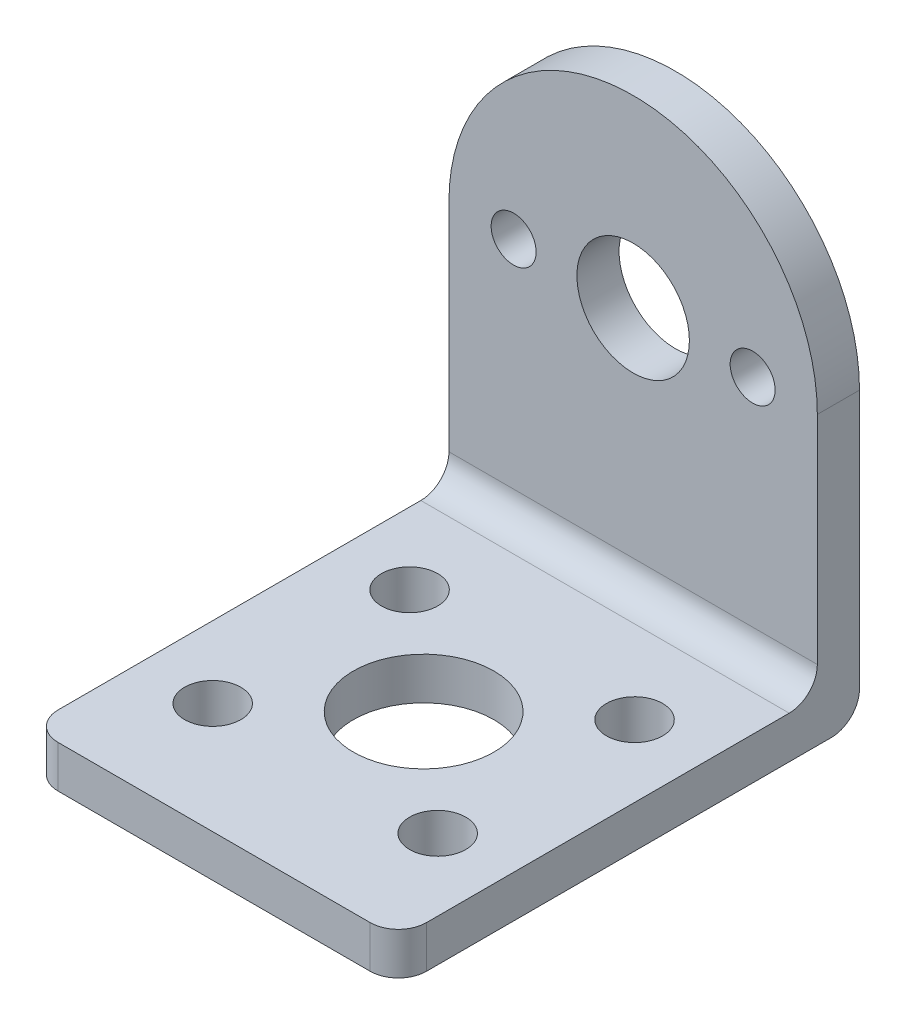
ISO-10303-21;
HEADER;
FILE_DESCRIPTION(('STEP AP214'),'2;1');
FILE_NAME('part.step','',(''),(''),'','','');
FILE_SCHEMA(('AUTOMOTIVE_DESIGN { 1 0 10303 214 1 1 1 1 }'));
ENDSEC;
DATA;
#1=APPLICATION_CONTEXT('core data for automotive mechanical design processes');
#2=APPLICATION_PROTOCOL_DEFINITION('international standard','automotive_design',2000,#1);
#3=PRODUCT_CONTEXT('',#1,'mechanical');
#4=PRODUCT('Part','Part','',(#3));
#5=PRODUCT_RELATED_PRODUCT_CATEGORY('part','',(#4));
#6=PRODUCT_DEFINITION_FORMATION('','',#4);
#7=PRODUCT_DEFINITION_CONTEXT('part definition',#1,'design');
#8=PRODUCT_DEFINITION('design','',#6,#7);
#9=PRODUCT_DEFINITION_SHAPE('','',#8);
#10=(LENGTH_UNIT() NAMED_UNIT(*) SI_UNIT(.MILLI.,.METRE.));
#11=(NAMED_UNIT(*) PLANE_ANGLE_UNIT() SI_UNIT($,.RADIAN.));
#12=(NAMED_UNIT(*) SI_UNIT($,.STERADIAN.) SOLID_ANGLE_UNIT());
#13=UNCERTAINTY_MEASURE_WITH_UNIT(LENGTH_MEASURE(1.E-05),#10,'distance_accuracy_value','');
#14=(GEOMETRIC_REPRESENTATION_CONTEXT(3) GLOBAL_UNCERTAINTY_ASSIGNED_CONTEXT((#13)) GLOBAL_UNIT_ASSIGNED_CONTEXT((#10,
#11,#12)) REPRESENTATION_CONTEXT('',''));
#15=CARTESIAN_POINT('',(0.,0.,0.));
#16=DIRECTION('',(0.,0.,1.));
#17=DIRECTION('',(1.,0.,0.));
#18=AXIS2_PLACEMENT_3D('',#15,#16,#17);
#19=CARTESIAN_POINT('',(0.,20.4,3.));
#20=DIRECTION('',(0.,0.,-1.));
#21=DIRECTION('',(-1.,0.,0.));
#22=AXIS2_PLACEMENT_3D('',#19,#20,#21);
#23=PLANE('',#22);
#24=DIRECTION('',(0.,-1.,0.));
#25=VECTOR('',#24,1.);
#26=CARTESIAN_POINT('',(-13.1,20.4,3.));
#27=LINE('',#26,#25);
#28=CARTESIAN_POINT('',(-13.1,20.4,3.));
#29=VERTEX_POINT('',#28);
#30=CARTESIAN_POINT('',(-13.1,5.,3.));
#31=VERTEX_POINT('',#30);
#32=EDGE_CURVE('E111',#29,#31,#27,.T.);
#33=ORIENTED_EDGE('',*,*,#32,.T.);
#34=DIRECTION('',(1.,0.,0.));
#35=VECTOR('',#34,1.);
#36=CARTESIAN_POINT('',(13.1,5.,3.));
#37=LINE('',#36,#35);
#38=CARTESIAN_POINT('',(13.1,5.,3.));
#39=VERTEX_POINT('',#38);
#40=EDGE_CURVE('E162',#31,#39,#37,.T.);
#41=ORIENTED_EDGE('',*,*,#40,.T.);
#42=DIRECTION('',(0.,1.,0.));
#43=VECTOR('',#42,1.);
#44=CARTESIAN_POINT('',(13.1,0.,3.));
#45=LINE('',#44,#43);
#46=CARTESIAN_POINT('',(13.1,20.4,3.));
#47=VERTEX_POINT('',#46);
#48=EDGE_CURVE('E123',#39,#47,#45,.T.);
#49=ORIENTED_EDGE('',*,*,#48,.T.);
#50=CARTESIAN_POINT('',(0.,20.4,3.));
#51=DIRECTION('',(0.,0.,1.));
#52=DIRECTION('',(-1.,0.,0.));
#53=AXIS2_PLACEMENT_3D('',#50,#51,#52);
#54=CIRCLE('',#53,13.1);
#55=EDGE_CURVE('E124',#47,#29,#54,.T.);
#56=ORIENTED_EDGE('',*,*,#55,.T.);
#57=EDGE_LOOP('',(#33,#41,#49,#56));
#58=FACE_BOUND('',#57,.T.);
#59=CARTESIAN_POINT('',(0.,20.4,3.));
#60=DIRECTION('',(0.,0.,1.));
#61=DIRECTION('',(1.,0.,0.));
#62=AXIS2_PLACEMENT_3D('',#59,#60,#61);
#63=CIRCLE('',#62,4.);
#64=CARTESIAN_POINT('',(4.,20.4,3.));
#65=VERTEX_POINT('',#64);
#66=EDGE_CURVE('E347',#65,#65,#63,.T.);
#67=ORIENTED_EDGE('',*,*,#66,.F.);
#68=EDGE_LOOP('',(#67));
#69=FACE_BOUND('',#68,.T.);
#70=CARTESIAN_POINT('',(-8.5,20.4,3.));
#71=DIRECTION('',(0.,0.,1.));
#72=DIRECTION('',(1.,0.,0.));
#73=AXIS2_PLACEMENT_3D('',#70,#71,#72);
#74=CIRCLE('',#73,1.6);
#75=CARTESIAN_POINT('',(-6.9,20.4,3.));
#76=VERTEX_POINT('',#75);
#77=EDGE_CURVE('E352',#76,#76,#74,.T.);
#78=ORIENTED_EDGE('',*,*,#77,.F.);
#79=EDGE_LOOP('',(#78));
#80=FACE_BOUND('',#79,.T.);
#81=CARTESIAN_POINT('',(8.5,20.4,3.));
#82=DIRECTION('',(0.,0.,1.));
#83=DIRECTION('',(1.,0.,0.));
#84=AXIS2_PLACEMENT_3D('',#81,#82,#83);
#85=CIRCLE('',#84,1.6);
#86=CARTESIAN_POINT('',(10.1,20.4,3.));
#87=VERTEX_POINT('',#86);
#88=EDGE_CURVE('E358',#87,#87,#85,.T.);
#89=ORIENTED_EDGE('',*,*,#88,.F.);
#90=EDGE_LOOP('',(#89));
#91=FACE_BOUND('',#90,.T.);
#92=ADVANCED_FACE('F33',(#58,#69,#80,#91),#23,.F.);
#93=CARTESIAN_POINT('',(0.,20.4,0.));
#94=DIRECTION('',(0.,0.,-1.));
#95=DIRECTION('',(-1.,0.,0.));
#96=AXIS2_PLACEMENT_3D('',#93,#94,#95);
#97=PLANE('',#96);
#98=CARTESIAN_POINT('',(-8.5,20.4,0.));
#99=DIRECTION('',(0.,0.,1.));
#100=DIRECTION('',(1.,0.,0.));
#101=AXIS2_PLACEMENT_3D('',#98,#99,#100);
#102=CIRCLE('',#101,1.6);
#103=CARTESIAN_POINT('',(-6.9,20.4,0.));
#104=VERTEX_POINT('',#103);
#105=EDGE_CURVE('E355',#104,#104,#102,.T.);
#106=ORIENTED_EDGE('',*,*,#105,.T.);
#107=EDGE_LOOP('',(#106));
#108=FACE_BOUND('',#107,.T.);
#109=DIRECTION('',(0.,1.,0.));
#110=VECTOR('',#109,1.);
#111=CARTESIAN_POINT('',(13.1,0.,0.));
#112=LINE('',#111,#110);
#113=CARTESIAN_POINT('',(13.1,2.,0.));
#114=VERTEX_POINT('',#113);
#115=CARTESIAN_POINT('',(13.1,20.4,0.));
#116=VERTEX_POINT('',#115);
#117=EDGE_CURVE('E132',#114,#116,#112,.T.);
#118=ORIENTED_EDGE('',*,*,#117,.F.);
#119=DIRECTION('',(1.,0.,0.));
#120=VECTOR('',#119,1.);
#121=CARTESIAN_POINT('',(-13.1,2.,0.));
#122=LINE('',#121,#120);
#123=CARTESIAN_POINT('',(-13.1,2.,0.));
#124=VERTEX_POINT('',#123);
#125=EDGE_CURVE('E156',#114,#124,#122,.F.);
#126=ORIENTED_EDGE('',*,*,#125,.T.);
#127=DIRECTION('',(0.,-1.,0.));
#128=VECTOR('',#127,1.);
#129=CARTESIAN_POINT('',(-13.1,20.4,0.));
#130=LINE('',#129,#128);
#131=CARTESIAN_POINT('',(-13.1,20.4,0.));
#132=VERTEX_POINT('',#131);
#133=EDGE_CURVE('E344',#132,#124,#130,.T.);
#134=ORIENTED_EDGE('',*,*,#133,.F.);
#135=CARTESIAN_POINT('',(0.,20.4,0.));
#136=DIRECTION('',(0.,0.,1.));
#137=DIRECTION('',(-1.,0.,0.));
#138=AXIS2_PLACEMENT_3D('',#135,#136,#137);
#139=CIRCLE('',#138,13.1);
#140=EDGE_CURVE('E136',#116,#132,#139,.T.);
#141=ORIENTED_EDGE('',*,*,#140,.F.);
#142=EDGE_LOOP('',(#118,#126,#134,#141));
#143=FACE_BOUND('',#142,.T.);
#144=CARTESIAN_POINT('',(0.,20.4,0.));
#145=DIRECTION('',(0.,0.,1.));
#146=DIRECTION('',(1.,0.,0.));
#147=AXIS2_PLACEMENT_3D('',#144,#145,#146);
#148=CIRCLE('',#147,4.);
#149=CARTESIAN_POINT('',(4.,20.4,0.));
#150=VERTEX_POINT('',#149);
#151=EDGE_CURVE('E349',#150,#150,#148,.T.);
#152=ORIENTED_EDGE('',*,*,#151,.T.);
#153=EDGE_LOOP('',(#152));
#154=FACE_BOUND('',#153,.T.);
#155=CARTESIAN_POINT('',(8.5,20.4,0.));
#156=DIRECTION('',(0.,0.,1.));
#157=DIRECTION('',(1.,0.,0.));
#158=AXIS2_PLACEMENT_3D('',#155,#156,#157);
#159=CIRCLE('',#158,1.6);
#160=CARTESIAN_POINT('',(10.1,20.4,0.));
#161=VERTEX_POINT('',#160);
#162=EDGE_CURVE('E361',#161,#161,#159,.T.);
#163=ORIENTED_EDGE('',*,*,#162,.T.);
#164=EDGE_LOOP('',(#163));
#165=FACE_BOUND('',#164,.T.);
#166=ADVANCED_FACE('F200',(#108,#143,#154,#165),#97,.T.);
#167=CARTESIAN_POINT('',(0.,20.4,3.));
#168=DIRECTION('',(0.,0.,-1.));
#169=DIRECTION('',(-1.,0.,0.));
#170=AXIS2_PLACEMENT_3D('',#167,#168,#169);
#171=CYLINDRICAL_SURFACE('',#170,13.1);
#172=ORIENTED_EDGE('',*,*,#140,.T.);
#173=DIRECTION('',(0.,0.,-1.));
#174=VECTOR('',#173,1.);
#175=CARTESIAN_POINT('',(-13.1,20.4,3.));
#176=LINE('',#175,#174);
#177=EDGE_CURVE('E116',#29,#132,#176,.T.);
#178=ORIENTED_EDGE('',*,*,#177,.F.);
#179=ORIENTED_EDGE('',*,*,#55,.F.);
#180=DIRECTION('',(0.,0.,-1.));
#181=VECTOR('',#180,1.);
#182=CARTESIAN_POINT('',(13.1,20.4,3.));
#183=LINE('',#182,#181);
#184=EDGE_CURVE('E340',#47,#116,#183,.T.);
#185=ORIENTED_EDGE('',*,*,#184,.T.);
#186=EDGE_LOOP('',(#172,#178,#179,#185));
#187=FACE_BOUND('',#186,.T.);
#188=ADVANCED_FACE('F134',(#187),#171,.T.);
#189=CARTESIAN_POINT('',(-13.1,20.4,3.));
#190=DIRECTION('',(1.,0.,0.));
#191=DIRECTION('',(0.,0.,-1.));
#192=AXIS2_PLACEMENT_3D('',#189,#190,#191);
#193=PLANE('',#192);
#194=ORIENTED_EDGE('',*,*,#133,.T.);
#195=CARTESIAN_POINT('',(-13.1,2.,2.));
#196=DIRECTION('',(1.,0.,0.));
#197=DIRECTION('',(0.,0.,-1.));
#198=AXIS2_PLACEMENT_3D('',#195,#196,#197);
#199=CIRCLE('',#198,2.);
#200=CARTESIAN_POINT('',(-13.1,0.,2.));
#201=VERTEX_POINT('',#200);
#202=EDGE_CURVE('E160',#124,#201,#199,.F.);
#203=ORIENTED_EDGE('',*,*,#202,.T.);
#204=DIRECTION('',(0.,0.,-1.));
#205=VECTOR('',#204,1.);
#206=CARTESIAN_POINT('',(-13.1,0.,3.));
#207=LINE('',#206,#205);
#208=CARTESIAN_POINT('',(-13.1,0.,30.8));
#209=VERTEX_POINT('',#208);
#210=EDGE_CURVE('E138',#209,#201,#207,.T.);
#211=ORIENTED_EDGE('',*,*,#210,.F.);
#212=DIRECTION('',(0.,-1.,0.));
#213=VECTOR('',#212,1.);
#214=CARTESIAN_POINT('',(-13.1,3.,30.8));
#215=LINE('',#214,#213);
#216=CARTESIAN_POINT('',(-13.1,3.,30.8));
#217=VERTEX_POINT('',#216);
#218=EDGE_CURVE('E158',#209,#217,#215,.F.);
#219=ORIENTED_EDGE('',*,*,#218,.T.);
#220=DIRECTION('',(0.,0.,-1.));
#221=VECTOR('',#220,1.);
#222=CARTESIAN_POINT('',(-13.1,3.,3.));
#223=LINE('',#222,#221);
#224=CARTESIAN_POINT('',(-13.1,3.,5.));
#225=VERTEX_POINT('',#224);
#226=EDGE_CURVE('E364',#217,#225,#223,.T.);
#227=ORIENTED_EDGE('',*,*,#226,.T.);
#228=CARTESIAN_POINT('',(-13.1,5.,5.));
#229=DIRECTION('',(1.,0.,0.));
#230=DIRECTION('',(0.,0.,-1.));
#231=AXIS2_PLACEMENT_3D('',#228,#229,#230);
#232=CIRCLE('',#231,2.);
#233=EDGE_CURVE('E11',#225,#31,#232,.T.);
#234=ORIENTED_EDGE('',*,*,#233,.T.);
#235=ORIENTED_EDGE('',*,*,#32,.F.);
#236=ORIENTED_EDGE('',*,*,#177,.T.);
#237=EDGE_LOOP('',(#194,#203,#211,#219,#227,#234,#235,#236));
#238=FACE_BOUND('',#237,.T.);
#239=ADVANCED_FACE('F114',(#238),#193,.F.);
#240=CARTESIAN_POINT('',(-13.1,0.,3.));
#241=DIRECTION('',(0.,1.,0.));
#242=DIRECTION('',(0.,0.,1.));
#243=AXIS2_PLACEMENT_3D('',#240,#241,#242);
#244=PLANE('',#243);
#245=ORIENTED_EDGE('',*,*,#210,.T.);
#246=DIRECTION('',(1.,0.,0.));
#247=VECTOR('',#246,1.);
#248=CARTESIAN_POINT('',(13.1,0.,2.));
#249=LINE('',#248,#247);
#250=CARTESIAN_POINT('',(13.1,0.,2.));
#251=VERTEX_POINT('',#250);
#252=EDGE_CURVE('E148',#201,#251,#249,.T.);
#253=ORIENTED_EDGE('',*,*,#252,.T.);
#254=DIRECTION('',(0.,0.,-1.));
#255=VECTOR('',#254,1.);
#256=CARTESIAN_POINT('',(13.1,0.,3.));
#257=LINE('',#256,#255);
#258=CARTESIAN_POINT('',(13.1,0.,30.8));
#259=VERTEX_POINT('',#258);
#260=EDGE_CURVE('E143',#259,#251,#257,.T.);
#261=ORIENTED_EDGE('',*,*,#260,.F.);
#262=CARTESIAN_POINT('',(11.1,0.,30.8));
#263=DIRECTION('',(0.,1.,0.));
#264=DIRECTION('',(0.,0.,1.));
#265=AXIS2_PLACEMENT_3D('',#262,#263,#264);
#266=CIRCLE('',#265,2.);
#267=CARTESIAN_POINT('',(11.1,0.,32.8));
#268=VERTEX_POINT('',#267);
#269=EDGE_CURVE('E137',#259,#268,#266,.F.);
#270=ORIENTED_EDGE('',*,*,#269,.T.);
#271=DIRECTION('',(-1.,0.,0.));
#272=VECTOR('',#271,1.);
#273=CARTESIAN_POINT('',(13.1,0.,32.8));
#274=LINE('',#273,#272);
#275=CARTESIAN_POINT('',(-11.1,0.,32.8));
#276=VERTEX_POINT('',#275);
#277=EDGE_CURVE('E184',#268,#276,#274,.T.);
#278=ORIENTED_EDGE('',*,*,#277,.T.);
#279=CARTESIAN_POINT('',(-11.1,0.,30.8));
#280=DIRECTION('',(0.,1.,0.));
#281=DIRECTION('',(0.,0.,1.));
#282=AXIS2_PLACEMENT_3D('',#279,#280,#281);
#283=CIRCLE('',#282,2.);
#284=EDGE_CURVE('E140',#276,#209,#283,.F.);
#285=ORIENTED_EDGE('',*,*,#284,.T.);
#286=EDGE_LOOP('',(#245,#253,#261,#270,#278,#285));
#287=FACE_BOUND('',#286,.T.);
#288=CARTESIAN_POINT('',(0.,0.,17.9));
#289=DIRECTION('',(0.,-1.,0.));
#290=DIRECTION('',(0.,0.,-1.));
#291=AXIS2_PLACEMENT_3D('',#288,#289,#290);
#292=CIRCLE('',#291,5.);
#293=CARTESIAN_POINT('',(0.,0.,12.9));
#294=VERTEX_POINT('',#293);
#295=EDGE_CURVE('E395',#294,#294,#292,.T.);
#296=ORIENTED_EDGE('',*,*,#295,.F.);
#297=EDGE_LOOP('',(#296));
#298=FACE_BOUND('',#297,.T.);
#299=CARTESIAN_POINT('',(-8.,0.,24.9));
#300=DIRECTION('',(0.,-1.,0.));
#301=DIRECTION('',(0.,0.,-1.));
#302=AXIS2_PLACEMENT_3D('',#299,#300,#301);
#303=CIRCLE('',#302,2.);
#304=CARTESIAN_POINT('',(-8.,0.,22.9));
#305=VERTEX_POINT('',#304);
#306=EDGE_CURVE('E389',#305,#305,#303,.T.);
#307=ORIENTED_EDGE('',*,*,#306,.F.);
#308=EDGE_LOOP('',(#307));
#309=FACE_BOUND('',#308,.T.);
#310=CARTESIAN_POINT('',(-8.,0.,10.9));
#311=DIRECTION('',(0.,-1.,0.));
#312=DIRECTION('',(0.,0.,-1.));
#313=AXIS2_PLACEMENT_3D('',#310,#311,#312);
#314=CIRCLE('',#313,2.);
#315=CARTESIAN_POINT('',(-8.,0.,8.89999999999999));
#316=VERTEX_POINT('',#315);
#317=EDGE_CURVE('E383',#316,#316,#314,.T.);
#318=ORIENTED_EDGE('',*,*,#317,.F.);
#319=EDGE_LOOP('',(#318));
#320=FACE_BOUND('',#319,.T.);
#321=CARTESIAN_POINT('',(8.,0.,24.9));
#322=DIRECTION('',(0.,-1.,0.));
#323=DIRECTION('',(0.,0.,-1.));
#324=AXIS2_PLACEMENT_3D('',#321,#322,#323);
#325=CIRCLE('',#324,2.);
#326=CARTESIAN_POINT('',(8.,0.,22.9));
#327=VERTEX_POINT('',#326);
#328=EDGE_CURVE('E377',#327,#327,#325,.T.);
#329=ORIENTED_EDGE('',*,*,#328,.F.);
#330=EDGE_LOOP('',(#329));
#331=FACE_BOUND('',#330,.T.);
#332=CARTESIAN_POINT('',(8.,0.,10.9));
#333=DIRECTION('',(0.,-1.,0.));
#334=DIRECTION('',(0.,0.,-1.));
#335=AXIS2_PLACEMENT_3D('',#332,#333,#334);
#336=CIRCLE('',#335,2.);
#337=CARTESIAN_POINT('',(8.,0.,8.89999999999999));
#338=VERTEX_POINT('',#337);
#339=EDGE_CURVE('E371',#338,#338,#336,.T.);
#340=ORIENTED_EDGE('',*,*,#339,.F.);
#341=EDGE_LOOP('',(#340));
#342=FACE_BOUND('',#341,.T.);
#343=ADVANCED_FACE('F213',(#287,#298,#309,#320,#331,#342),#244,.F.);
#344=CARTESIAN_POINT('',(13.1,0.,3.));
#345=DIRECTION('',(-1.,0.,0.));
#346=DIRECTION('',(0.,0.,1.));
#347=AXIS2_PLACEMENT_3D('',#344,#345,#346);
#348=PLANE('',#347);
#349=ORIENTED_EDGE('',*,*,#260,.T.);
#350=CARTESIAN_POINT('',(13.1,2.,2.));
#351=DIRECTION('',(-1.,0.,0.));
#352=DIRECTION('',(0.,0.,1.));
#353=AXIS2_PLACEMENT_3D('',#350,#351,#352);
#354=CIRCLE('',#353,2.);
#355=EDGE_CURVE('E154',#251,#114,#354,.F.);
#356=ORIENTED_EDGE('',*,*,#355,.T.);
#357=ORIENTED_EDGE('',*,*,#117,.T.);
#358=ORIENTED_EDGE('',*,*,#184,.F.);
#359=ORIENTED_EDGE('',*,*,#48,.F.);
#360=CARTESIAN_POINT('',(13.1,5.,5.));
#361=DIRECTION('',(-1.,0.,0.));
#362=DIRECTION('',(0.,0.,1.));
#363=AXIS2_PLACEMENT_3D('',#360,#361,#362);
#364=CIRCLE('',#363,2.);
#365=CARTESIAN_POINT('',(13.1,3.,5.));
#366=VERTEX_POINT('',#365);
#367=EDGE_CURVE('E41',#39,#366,#364,.T.);
#368=ORIENTED_EDGE('',*,*,#367,.T.);
#369=DIRECTION('',(0.,0.,1.));
#370=VECTOR('',#369,1.);
#371=CARTESIAN_POINT('',(13.1,3.,3.));
#372=LINE('',#371,#370);
#373=CARTESIAN_POINT('',(13.1,3.,30.8));
#374=VERTEX_POINT('',#373);
#375=EDGE_CURVE('E177',#366,#374,#372,.T.);
#376=ORIENTED_EDGE('',*,*,#375,.T.);
#377=DIRECTION('',(0.,-1.,0.));
#378=VECTOR('',#377,1.);
#379=CARTESIAN_POINT('',(13.1,0.,30.8));
#380=LINE('',#379,#378);
#381=EDGE_CURVE('E151',#374,#259,#380,.T.);
#382=ORIENTED_EDGE('',*,*,#381,.T.);
#383=EDGE_LOOP('',(#349,#356,#357,#358,#359,#368,#376,#382));
#384=FACE_BOUND('',#383,.T.);
#385=ADVANCED_FACE('F176',(#384),#348,.F.);
#386=CARTESIAN_POINT('',(0.,20.4,3.));
#387=DIRECTION('',(0.,0.,-1.));
#388=DIRECTION('',(-1.,0.,0.));
#389=AXIS2_PLACEMENT_3D('',#386,#387,#388);
#390=CYLINDRICAL_SURFACE('',#389,4.);
#391=ORIENTED_EDGE('',*,*,#66,.T.);
#392=EDGE_LOOP('',(#391));
#393=FACE_BOUND('',#392,.T.);
#394=ORIENTED_EDGE('',*,*,#151,.F.);
#395=EDGE_LOOP('',(#394));
#396=FACE_BOUND('',#395,.T.);
#397=ADVANCED_FACE('F208',(#393,#396),#390,.F.);
#398=CARTESIAN_POINT('',(-8.5,20.4,3.));
#399=DIRECTION('',(0.,0.,-1.));
#400=DIRECTION('',(-1.,0.,0.));
#401=AXIS2_PLACEMENT_3D('',#398,#399,#400);
#402=CYLINDRICAL_SURFACE('',#401,1.6);
#403=ORIENTED_EDGE('',*,*,#77,.T.);
#404=EDGE_LOOP('',(#403));
#405=FACE_BOUND('',#404,.T.);
#406=ORIENTED_EDGE('',*,*,#105,.F.);
#407=EDGE_LOOP('',(#406));
#408=FACE_BOUND('',#407,.T.);
#409=ADVANCED_FACE('F243',(#405,#408),#402,.F.);
#410=CARTESIAN_POINT('',(8.5,20.4,3.));
#411=DIRECTION('',(0.,0.,-1.));
#412=DIRECTION('',(-1.,0.,0.));
#413=AXIS2_PLACEMENT_3D('',#410,#411,#412);
#414=CYLINDRICAL_SURFACE('',#413,1.6);
#415=ORIENTED_EDGE('',*,*,#88,.T.);
#416=EDGE_LOOP('',(#415));
#417=FACE_BOUND('',#416,.T.);
#418=ORIENTED_EDGE('',*,*,#162,.F.);
#419=EDGE_LOOP('',(#418));
#420=FACE_BOUND('',#419,.T.);
#421=ADVANCED_FACE('F250',(#417,#420),#414,.F.);
#422=CARTESIAN_POINT('',(13.1,3.,32.8));
#423=DIRECTION('',(0.,0.,1.));
#424=DIRECTION('',(1.,0.,0.));
#425=AXIS2_PLACEMENT_3D('',#422,#423,#424);
#426=PLANE('',#425);
#427=DIRECTION('',(-1.,0.,0.));
#428=VECTOR('',#427,1.);
#429=CARTESIAN_POINT('',(13.1,3.,32.8));
#430=LINE('',#429,#428);
#431=CARTESIAN_POINT('',(11.1,3.,32.8));
#432=VERTEX_POINT('',#431);
#433=CARTESIAN_POINT('',(-11.1,3.,32.8));
#434=VERTEX_POINT('',#433);
#435=EDGE_CURVE('E183',#432,#434,#430,.T.);
#436=ORIENTED_EDGE('',*,*,#435,.T.);
#437=DIRECTION('',(0.,-1.,0.));
#438=VECTOR('',#437,1.);
#439=CARTESIAN_POINT('',(-11.1,0.,32.8));
#440=LINE('',#439,#438);
#441=EDGE_CURVE('E170',#434,#276,#440,.T.);
#442=ORIENTED_EDGE('',*,*,#441,.T.);
#443=ORIENTED_EDGE('',*,*,#277,.F.);
#444=DIRECTION('',(0.,-1.,0.));
#445=VECTOR('',#444,1.);
#446=CARTESIAN_POINT('',(11.1,3.,32.8));
#447=LINE('',#446,#445);
#448=EDGE_CURVE('E55',#268,#432,#447,.F.);
#449=ORIENTED_EDGE('',*,*,#448,.T.);
#450=EDGE_LOOP('',(#436,#442,#443,#449));
#451=FACE_BOUND('',#450,.T.);
#452=ADVANCED_FACE('F257',(#451),#426,.T.);
#453=CARTESIAN_POINT('',(0.,3.,0.));
#454=DIRECTION('',(0.,-1.,0.));
#455=DIRECTION('',(0.,0.,-1.));
#456=AXIS2_PLACEMENT_3D('',#453,#454,#455);
#457=PLANE('',#456);
#458=CARTESIAN_POINT('',(0.,3.,17.9));
#459=DIRECTION('',(0.,-1.,0.));
#460=DIRECTION('',(0.,0.,-1.));
#461=AXIS2_PLACEMENT_3D('',#458,#459,#460);
#462=CIRCLE('',#461,5.);
#463=CARTESIAN_POINT('',(0.,3.,12.9));
#464=VERTEX_POINT('',#463);
#465=EDGE_CURVE('E392',#464,#464,#462,.T.);
#466=ORIENTED_EDGE('',*,*,#465,.T.);
#467=EDGE_LOOP('',(#466));
#468=FACE_BOUND('',#467,.T.);
#469=CARTESIAN_POINT('',(-8.,3.,24.9));
#470=DIRECTION('',(0.,-1.,0.));
#471=DIRECTION('',(0.,0.,-1.));
#472=AXIS2_PLACEMENT_3D('',#469,#470,#471);
#473=CIRCLE('',#472,2.);
#474=CARTESIAN_POINT('',(-8.,3.,22.9));
#475=VERTEX_POINT('',#474);
#476=EDGE_CURVE('E386',#475,#475,#473,.T.);
#477=ORIENTED_EDGE('',*,*,#476,.T.);
#478=EDGE_LOOP('',(#477));
#479=FACE_BOUND('',#478,.T.);
#480=CARTESIAN_POINT('',(-8.,3.,10.9));
#481=DIRECTION('',(0.,-1.,0.));
#482=DIRECTION('',(0.,0.,-1.));
#483=AXIS2_PLACEMENT_3D('',#480,#481,#482);
#484=CIRCLE('',#483,2.);
#485=CARTESIAN_POINT('',(-8.,3.,8.89999999999999));
#486=VERTEX_POINT('',#485);
#487=EDGE_CURVE('E380',#486,#486,#484,.T.);
#488=ORIENTED_EDGE('',*,*,#487,.T.);
#489=EDGE_LOOP('',(#488));
#490=FACE_BOUND('',#489,.T.);
#491=CARTESIAN_POINT('',(8.,3.,24.9));
#492=DIRECTION('',(0.,-1.,0.));
#493=DIRECTION('',(0.,0.,-1.));
#494=AXIS2_PLACEMENT_3D('',#491,#492,#493);
#495=CIRCLE('',#494,2.);
#496=CARTESIAN_POINT('',(8.,3.,22.9));
#497=VERTEX_POINT('',#496);
#498=EDGE_CURVE('E374',#497,#497,#495,.T.);
#499=ORIENTED_EDGE('',*,*,#498,.T.);
#500=EDGE_LOOP('',(#499));
#501=FACE_BOUND('',#500,.T.);
#502=CARTESIAN_POINT('',(8.,3.,10.9));
#503=DIRECTION('',(0.,-1.,0.));
#504=DIRECTION('',(0.,0.,-1.));
#505=AXIS2_PLACEMENT_3D('',#502,#503,#504);
#506=CIRCLE('',#505,2.);
#507=CARTESIAN_POINT('',(8.,3.,8.89999999999999));
#508=VERTEX_POINT('',#507);
#509=EDGE_CURVE('E368',#508,#508,#506,.T.);
#510=ORIENTED_EDGE('',*,*,#509,.T.);
#511=EDGE_LOOP('',(#510));
#512=FACE_BOUND('',#511,.T.);
#513=ORIENTED_EDGE('',*,*,#375,.F.);
#514=DIRECTION('',(1.,0.,0.));
#515=VECTOR('',#514,1.);
#516=CARTESIAN_POINT('',(-13.1,3.,5.));
#517=LINE('',#516,#515);
#518=EDGE_CURVE('E167',#366,#225,#517,.F.);
#519=ORIENTED_EDGE('',*,*,#518,.T.);
#520=ORIENTED_EDGE('',*,*,#226,.F.);
#521=CARTESIAN_POINT('',(-11.1,3.,30.8));
#522=DIRECTION('',(0.,-1.,0.));
#523=DIRECTION('',(0.,0.,-1.));
#524=AXIS2_PLACEMENT_3D('',#521,#522,#523);
#525=CIRCLE('',#524,2.);
#526=EDGE_CURVE('E48',#217,#434,#525,.F.);
#527=ORIENTED_EDGE('',*,*,#526,.T.);
#528=ORIENTED_EDGE('',*,*,#435,.F.);
#529=CARTESIAN_POINT('',(11.1,3.,30.8));
#530=DIRECTION('',(0.,-1.,0.));
#531=DIRECTION('',(0.,0.,-1.));
#532=AXIS2_PLACEMENT_3D('',#529,#530,#531);
#533=CIRCLE('',#532,2.);
#534=EDGE_CURVE('E164',#432,#374,#533,.F.);
#535=ORIENTED_EDGE('',*,*,#534,.T.);
#536=EDGE_LOOP('',(#513,#519,#520,#527,#528,#535));
#537=FACE_BOUND('',#536,.T.);
#538=ADVANCED_FACE('F181',(#468,#479,#490,#501,#512,#537),#457,.F.);
#539=CARTESIAN_POINT('',(8.,3.,10.9));
#540=DIRECTION('',(0.,-1.,0.));
#541=DIRECTION('',(0.,0.,-1.));
#542=AXIS2_PLACEMENT_3D('',#539,#540,#541);
#543=CYLINDRICAL_SURFACE('',#542,2.);
#544=ORIENTED_EDGE('',*,*,#509,.F.);
#545=EDGE_LOOP('',(#544));
#546=FACE_BOUND('',#545,.T.);
#547=ORIENTED_EDGE('',*,*,#339,.T.);
#548=EDGE_LOOP('',(#547));
#549=FACE_BOUND('',#548,.T.);
#550=ADVANCED_FACE('F271',(#546,#549),#543,.F.);
#551=CARTESIAN_POINT('',(8.,3.,24.9));
#552=DIRECTION('',(0.,-1.,0.));
#553=DIRECTION('',(0.,0.,-1.));
#554=AXIS2_PLACEMENT_3D('',#551,#552,#553);
#555=CYLINDRICAL_SURFACE('',#554,2.);
#556=ORIENTED_EDGE('',*,*,#498,.F.);
#557=EDGE_LOOP('',(#556));
#558=FACE_BOUND('',#557,.T.);
#559=ORIENTED_EDGE('',*,*,#328,.T.);
#560=EDGE_LOOP('',(#559));
#561=FACE_BOUND('',#560,.T.);
#562=ADVANCED_FACE('F279',(#558,#561),#555,.F.);
#563=CARTESIAN_POINT('',(-8.,3.,10.9));
#564=DIRECTION('',(0.,-1.,0.));
#565=DIRECTION('',(0.,0.,-1.));
#566=AXIS2_PLACEMENT_3D('',#563,#564,#565);
#567=CYLINDRICAL_SURFACE('',#566,2.);
#568=ORIENTED_EDGE('',*,*,#487,.F.);
#569=EDGE_LOOP('',(#568));
#570=FACE_BOUND('',#569,.T.);
#571=ORIENTED_EDGE('',*,*,#317,.T.);
#572=EDGE_LOOP('',(#571));
#573=FACE_BOUND('',#572,.T.);
#574=ADVANCED_FACE('F287',(#570,#573),#567,.F.);
#575=CARTESIAN_POINT('',(-8.,3.,24.9));
#576=DIRECTION('',(0.,-1.,0.));
#577=DIRECTION('',(0.,0.,-1.));
#578=AXIS2_PLACEMENT_3D('',#575,#576,#577);
#579=CYLINDRICAL_SURFACE('',#578,2.);
#580=ORIENTED_EDGE('',*,*,#476,.F.);
#581=EDGE_LOOP('',(#580));
#582=FACE_BOUND('',#581,.T.);
#583=ORIENTED_EDGE('',*,*,#306,.T.);
#584=EDGE_LOOP('',(#583));
#585=FACE_BOUND('',#584,.T.);
#586=ADVANCED_FACE('F295',(#582,#585),#579,.F.);
#587=CARTESIAN_POINT('',(0.,3.,17.9));
#588=DIRECTION('',(0.,-1.,0.));
#589=DIRECTION('',(0.,0.,-1.));
#590=AXIS2_PLACEMENT_3D('',#587,#588,#589);
#591=CYLINDRICAL_SURFACE('',#590,5.);
#592=ORIENTED_EDGE('',*,*,#465,.F.);
#593=EDGE_LOOP('',(#592));
#594=FACE_BOUND('',#593,.T.);
#595=ORIENTED_EDGE('',*,*,#295,.T.);
#596=EDGE_LOOP('',(#595));
#597=FACE_BOUND('',#596,.T.);
#598=ADVANCED_FACE('F196',(#594,#597),#591,.F.);
#599=CARTESIAN_POINT('',(-13.1,2.,2.));
#600=DIRECTION('',(-1.,0.,0.));
#601=DIRECTION('',(0.,0.,1.));
#602=AXIS2_PLACEMENT_3D('',#599,#600,#601);
#603=CYLINDRICAL_SURFACE('',#602,2.);
#604=ORIENTED_EDGE('',*,*,#202,.F.);
#605=ORIENTED_EDGE('',*,*,#125,.F.);
#606=ORIENTED_EDGE('',*,*,#355,.F.);
#607=ORIENTED_EDGE('',*,*,#252,.F.);
#608=EDGE_LOOP('',(#604,#605,#606,#607));
#609=FACE_BOUND('',#608,.T.);
#610=ADVANCED_FACE('F189',(#609),#603,.T.);
#611=CARTESIAN_POINT('',(0.,5.,5.));
#612=DIRECTION('',(-1.,0.,0.));
#613=DIRECTION('',(0.,0.,1.));
#614=AXIS2_PLACEMENT_3D('',#611,#612,#613);
#615=CYLINDRICAL_SURFACE('',#614,2.);
#616=ORIENTED_EDGE('',*,*,#233,.F.);
#617=ORIENTED_EDGE('',*,*,#518,.F.);
#618=ORIENTED_EDGE('',*,*,#367,.F.);
#619=ORIENTED_EDGE('',*,*,#40,.F.);
#620=EDGE_LOOP('',(#616,#617,#618,#619));
#621=FACE_BOUND('',#620,.T.);
#622=ADVANCED_FACE('F186',(#621),#615,.F.);
#623=CARTESIAN_POINT('',(-11.1,3.,30.8));
#624=DIRECTION('',(0.,1.,0.));
#625=DIRECTION('',(0.,0.,1.));
#626=AXIS2_PLACEMENT_3D('',#623,#624,#625);
#627=CYLINDRICAL_SURFACE('',#626,2.);
#628=ORIENTED_EDGE('',*,*,#526,.F.);
#629=ORIENTED_EDGE('',*,*,#218,.F.);
#630=ORIENTED_EDGE('',*,*,#284,.F.);
#631=ORIENTED_EDGE('',*,*,#441,.F.);
#632=EDGE_LOOP('',(#628,#629,#630,#631));
#633=FACE_BOUND('',#632,.T.);
#634=ADVANCED_FACE('F188',(#633),#627,.T.);
#635=CARTESIAN_POINT('',(11.1,0.,30.8));
#636=DIRECTION('',(0.,1.,0.));
#637=DIRECTION('',(0.,0.,1.));
#638=AXIS2_PLACEMENT_3D('',#635,#636,#637);
#639=CYLINDRICAL_SURFACE('',#638,2.);
#640=ORIENTED_EDGE('',*,*,#534,.F.);
#641=ORIENTED_EDGE('',*,*,#448,.F.);
#642=ORIENTED_EDGE('',*,*,#269,.F.);
#643=ORIENTED_EDGE('',*,*,#381,.F.);
#644=EDGE_LOOP('',(#640,#641,#642,#643));
#645=FACE_BOUND('',#644,.T.);
#646=ADVANCED_FACE('F35',(#645),#639,.T.);
#647=CLOSED_SHELL('',(#92,#166,#188,#239,#343,#385,#397,#409,#421,#452,#538,#550,#562,#574,#586,
#598,#610,#622,#634,#646));
#648=MANIFOLD_SOLID_BREP('B2',#647);
#649=ADVANCED_BREP_SHAPE_REPRESENTATION('',(#18,#648),#14);
#650=SHAPE_DEFINITION_REPRESENTATION(#9,#649);
ENDSEC;
END-ISO-10303-21;
